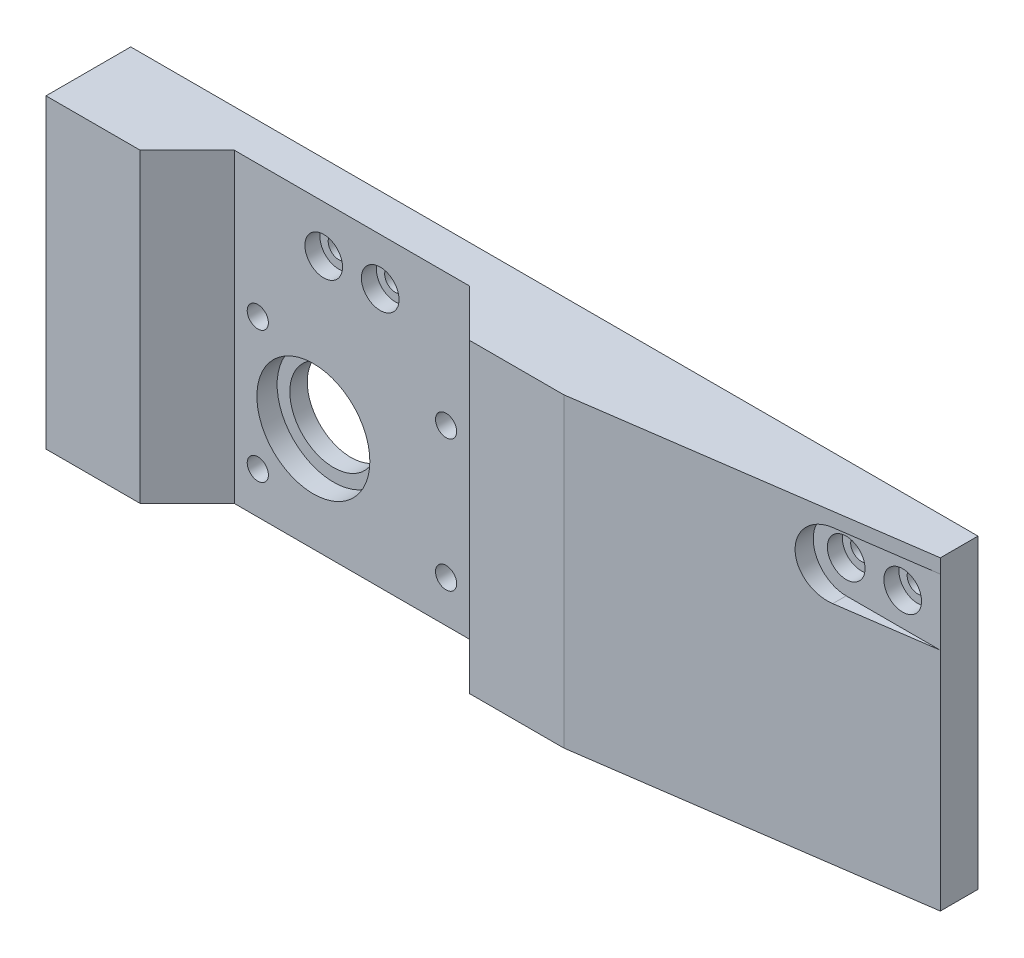
ISO-10303-21;
HEADER;
FILE_DESCRIPTION(('STEP AP214'),'2;1');
FILE_NAME('part.step','',(''),(''),'','','');
FILE_SCHEMA(('AUTOMOTIVE_DESIGN { 1 0 10303 214 1 1 1 1 }'));
ENDSEC;
DATA;
#1=APPLICATION_CONTEXT('core data for automotive mechanical design processes');
#2=APPLICATION_PROTOCOL_DEFINITION('international standard','automotive_design',2000,#1);
#3=PRODUCT_CONTEXT('',#1,'mechanical');
#4=PRODUCT('Part','Part','',(#3));
#5=PRODUCT_RELATED_PRODUCT_CATEGORY('part','',(#4));
#6=PRODUCT_DEFINITION_FORMATION('','',#4);
#7=PRODUCT_DEFINITION_CONTEXT('part definition',#1,'design');
#8=PRODUCT_DEFINITION('design','',#6,#7);
#9=PRODUCT_DEFINITION_SHAPE('','',#8);
#10=(LENGTH_UNIT() NAMED_UNIT(*) SI_UNIT(.MILLI.,.METRE.));
#11=(NAMED_UNIT(*) PLANE_ANGLE_UNIT() SI_UNIT($,.RADIAN.));
#12=(NAMED_UNIT(*) SI_UNIT($,.STERADIAN.) SOLID_ANGLE_UNIT());
#13=UNCERTAINTY_MEASURE_WITH_UNIT(LENGTH_MEASURE(1.E-05),#10,'distance_accuracy_value','');
#14=(GEOMETRIC_REPRESENTATION_CONTEXT(3) GLOBAL_UNCERTAINTY_ASSIGNED_CONTEXT((#13)) GLOBAL_UNIT_ASSIGNED_CONTEXT((#10,
#11,#12)) REPRESENTATION_CONTEXT('',''));
#15=CARTESIAN_POINT('',(0.,0.,0.));
#16=DIRECTION('',(0.,0.,1.));
#17=DIRECTION('',(1.,0.,0.));
#18=AXIS2_PLACEMENT_3D('',#15,#16,#17);
#19=CARTESIAN_POINT('',(110.,65.,18.));
#20=DIRECTION('',(-0.14142135623731,0.,-0.989949493661166));
#21=DIRECTION('',(-0.989949493661167,0.,0.14142135623731));
#22=AXIS2_PLACEMENT_3D('',#19,#20,#21);
#23=PLANE('',#22);
#24=DIRECTION('',(-0.989949493661167,0.,0.14142135623731));
#25=VECTOR('',#24,1.);
#26=CARTESIAN_POINT('',(110.,62.,18.));
#27=LINE('',#26,#25);
#28=CARTESIAN_POINT('',(180.,62.,8.));
#29=VERTEX_POINT('',#28);
#30=CARTESIAN_POINT('',(160.,62.,10.8571428571429));
#31=VERTEX_POINT('',#30);
#32=EDGE_CURVE('E11',#29,#31,#27,.T.);
#33=ORIENTED_EDGE('',*,*,#32,.F.);
#34=DIRECTION('',(0.,-1.,0.));
#35=VECTOR('',#34,1.);
#36=CARTESIAN_POINT('',(180.,65.,8.00000000000001));
#37=LINE('',#36,#35);
#38=CARTESIAN_POINT('',(180.,65.,8.00000000000001));
#39=VERTEX_POINT('',#38);
#40=EDGE_CURVE('E167',#39,#29,#37,.T.);
#41=ORIENTED_EDGE('',*,*,#40,.F.);
#42=DIRECTION('',(0.989949493661166,0.,-0.14142135623731));
#43=VECTOR('',#42,1.);
#44=CARTESIAN_POINT('',(110.,65.,18.));
#45=LINE('',#44,#43);
#46=CARTESIAN_POINT('',(110.,65.,18.));
#47=VERTEX_POINT('',#46);
#48=EDGE_CURVE('E56',#47,#39,#45,.T.);
#49=ORIENTED_EDGE('',*,*,#48,.F.);
#50=DIRECTION('',(0.,-1.,0.));
#51=VECTOR('',#50,1.);
#52=CARTESIAN_POINT('',(110.,65.,18.));
#53=LINE('',#52,#51);
#54=CARTESIAN_POINT('',(110.,0.,18.));
#55=VERTEX_POINT('',#54);
#56=EDGE_CURVE('E140',#47,#55,#53,.T.);
#57=ORIENTED_EDGE('',*,*,#56,.T.);
#58=DIRECTION('',(0.989949493661166,0.,-0.14142135623731));
#59=VECTOR('',#58,1.);
#60=CARTESIAN_POINT('',(110.,0.,18.));
#61=LINE('',#60,#59);
#62=CARTESIAN_POINT('',(180.,0.,8.00000000000001));
#63=VERTEX_POINT('',#62);
#64=EDGE_CURVE('E164',#55,#63,#61,.T.);
#65=ORIENTED_EDGE('',*,*,#64,.T.);
#66=CARTESIAN_POINT('',(180.,48.,8.00000000000001));
#67=VERTEX_POINT('',#66);
#68=EDGE_CURVE('E93',#67,#63,#37,.T.);
#69=ORIENTED_EDGE('',*,*,#68,.F.);
#70=DIRECTION('',(0.989949493661167,0.,-0.14142135623731));
#71=VECTOR('',#70,1.);
#72=CARTESIAN_POINT('',(110.,48.,18.));
#73=LINE('',#72,#71);
#74=CARTESIAN_POINT('',(160.,48.,10.8571428571429));
#75=VERTEX_POINT('',#74);
#76=EDGE_CURVE('E187',#75,#67,#73,.T.);
#77=ORIENTED_EDGE('',*,*,#76,.F.);
#78=CARTESIAN_POINT('',(160.,55.,10.8571428571429));
#79=DIRECTION('',(-0.14142135623731,0.,-0.989949493661166));
#80=DIRECTION('',(0.989949493661167,0.,-0.14142135623731));
#81=AXIS2_PLACEMENT_3D('',#78,#79,#80);
#82=ELLIPSE('',#81,7.07106781186547,7.);
#83=EDGE_CURVE('E40',#31,#75,#82,.F.);
#84=ORIENTED_EDGE('',*,*,#83,.F.);
#85=EDGE_LOOP('',(#33,#41,#49,#57,#65,#69,#77,#84));
#86=FACE_BOUND('',#85,.T.);
#87=ADVANCED_FACE('F32',(#86),#23,.F.);
#88=CARTESIAN_POINT('',(180.,65.,8.00000000000001));
#89=DIRECTION('',(-1.,0.,0.));
#90=DIRECTION('',(0.,0.,1.));
#91=AXIS2_PLACEMENT_3D('',#88,#89,#90);
#92=PLANE('',#91);
#93=DIRECTION('',(0.,0.,-1.));
#94=VECTOR('',#93,1.);
#95=CARTESIAN_POINT('',(180.,0.,8.00000000000001));
#96=LINE('',#95,#94);
#97=CARTESIAN_POINT('',(180.,0.,0.));
#98=VERTEX_POINT('',#97);
#99=EDGE_CURVE('E148',#63,#98,#96,.T.);
#100=ORIENTED_EDGE('',*,*,#99,.T.);
#101=DIRECTION('',(0.,-1.,0.));
#102=VECTOR('',#101,1.);
#103=CARTESIAN_POINT('',(180.,65.,0.));
#104=LINE('',#103,#102);
#105=CARTESIAN_POINT('',(180.,65.,0.));
#106=VERTEX_POINT('',#105);
#107=EDGE_CURVE('E185',#106,#98,#104,.T.);
#108=ORIENTED_EDGE('',*,*,#107,.F.);
#109=DIRECTION('',(0.,0.,-1.));
#110=VECTOR('',#109,1.);
#111=CARTESIAN_POINT('',(180.,65.,8.00000000000001));
#112=LINE('',#111,#110);
#113=EDGE_CURVE('E166',#39,#106,#112,.T.);
#114=ORIENTED_EDGE('',*,*,#113,.F.);
#115=ORIENTED_EDGE('',*,*,#40,.T.);
#116=EDGE_CURVE('E170',#29,#67,#37,.T.);
#117=ORIENTED_EDGE('',*,*,#116,.T.);
#118=ORIENTED_EDGE('',*,*,#68,.T.);
#119=EDGE_LOOP('',(#100,#108,#114,#115,#117,#118));
#120=FACE_BOUND('',#119,.T.);
#121=ADVANCED_FACE('F34',(#120),#92,.F.);
#122=CARTESIAN_POINT('',(180.,65.,0.));
#123=DIRECTION('',(0.,0.,1.));
#124=DIRECTION('',(1.,0.,0.));
#125=AXIS2_PLACEMENT_3D('',#122,#123,#124);
#126=PLANE('',#125);
#127=CARTESIAN_POINT('',(35.,36.853925583054,0.));
#128=DIRECTION('',(0.,0.,1.));
#129=DIRECTION('',(1.,0.,0.));
#130=AXIS2_PLACEMENT_3D('',#127,#128,#129);
#131=CIRCLE('',#130,2.25);
#132=CARTESIAN_POINT('',(37.25,36.853925583054,0.));
#133=VERTEX_POINT('',#132);
#134=EDGE_CURVE('E692',#133,#133,#131,.T.);
#135=ORIENTED_EDGE('',*,*,#134,.T.);
#136=EDGE_LOOP('',(#135));
#137=FACE_BOUND('',#136,.T.);
#138=CARTESIAN_POINT('',(75.,36.853925583054,0.));
#139=DIRECTION('',(0.,0.,1.));
#140=DIRECTION('',(1.,0.,0.));
#141=AXIS2_PLACEMENT_3D('',#138,#139,#140);
#142=CIRCLE('',#141,2.25);
#143=CARTESIAN_POINT('',(77.25,36.853925583054,0.));
#144=VERTEX_POINT('',#143);
#145=EDGE_CURVE('E702',#144,#144,#142,.T.);
#146=ORIENTED_EDGE('',*,*,#145,.T.);
#147=EDGE_LOOP('',(#146));
#148=FACE_BOUND('',#147,.T.);
#149=CARTESIAN_POINT('',(75.,8.85392558305398,0.));
#150=DIRECTION('',(0.,0.,1.));
#151=DIRECTION('',(1.,0.,0.));
#152=AXIS2_PLACEMENT_3D('',#149,#150,#151);
#153=CIRCLE('',#152,2.25);
#154=CARTESIAN_POINT('',(77.25,8.85392558305398,0.));
#155=VERTEX_POINT('',#154);
#156=EDGE_CURVE('E708',#155,#155,#153,.T.);
#157=ORIENTED_EDGE('',*,*,#156,.T.);
#158=EDGE_LOOP('',(#157));
#159=FACE_BOUND('',#158,.T.);
#160=CARTESIAN_POINT('',(35.,8.85392558305398,0.));
#161=DIRECTION('',(0.,0.,1.));
#162=DIRECTION('',(1.,0.,0.));
#163=AXIS2_PLACEMENT_3D('',#160,#161,#162);
#164=CIRCLE('',#163,2.25);
#165=CARTESIAN_POINT('',(37.25,8.85392558305398,0.));
#166=VERTEX_POINT('',#165);
#167=EDGE_CURVE('E714',#166,#166,#164,.T.);
#168=ORIENTED_EDGE('',*,*,#167,.T.);
#169=EDGE_LOOP('',(#168));
#170=FACE_BOUND('',#169,.T.);
#171=CARTESIAN_POINT('',(46.8,22.15,0.));
#172=DIRECTION('',(0.,0.,1.));
#173=DIRECTION('',(1.,0.,0.));
#174=AXIS2_PLACEMENT_3D('',#171,#172,#173);
#175=CIRCLE('',#174,9.30000000000001);
#176=CARTESIAN_POINT('',(56.1,22.15,0.));
#177=VERTEX_POINT('',#176);
#178=EDGE_CURVE('E720',#177,#177,#175,.F.);
#179=ORIENTED_EDGE('',*,*,#178,.F.);
#180=EDGE_LOOP('',(#179));
#181=FACE_BOUND('',#180,.T.);
#182=CARTESIAN_POINT('',(160.,55.,0.));
#183=DIRECTION('',(0.,0.,1.));
#184=DIRECTION('',(1.,0.,0.));
#185=AXIS2_PLACEMENT_3D('',#182,#183,#184);
#186=CIRCLE('',#185,2.25);
#187=CARTESIAN_POINT('',(162.25,55.,0.));
#188=VERTEX_POINT('',#187);
#189=EDGE_CURVE('E738',#188,#188,#186,.T.);
#190=ORIENTED_EDGE('',*,*,#189,.T.);
#191=EDGE_LOOP('',(#190));
#192=FACE_BOUND('',#191,.T.);
#193=CARTESIAN_POINT('',(172.,55.,0.));
#194=DIRECTION('',(0.,0.,1.));
#195=DIRECTION('',(1.,0.,0.));
#196=AXIS2_PLACEMENT_3D('',#193,#194,#195);
#197=CIRCLE('',#196,2.25);
#198=CARTESIAN_POINT('',(174.25,55.,0.));
#199=VERTEX_POINT('',#198);
#200=EDGE_CURVE('E750',#199,#199,#197,.T.);
#201=ORIENTED_EDGE('',*,*,#200,.T.);
#202=EDGE_LOOP('',(#201));
#203=FACE_BOUND('',#202,.T.);
#204=CARTESIAN_POINT('',(49.,55.,0.));
#205=DIRECTION('',(0.,0.,1.));
#206=DIRECTION('',(1.,0.,0.));
#207=AXIS2_PLACEMENT_3D('',#204,#205,#206);
#208=CIRCLE('',#207,2.25);
#209=CARTESIAN_POINT('',(51.25,55.,0.));
#210=VERTEX_POINT('',#209);
#211=EDGE_CURVE('E762',#210,#210,#208,.T.);
#212=ORIENTED_EDGE('',*,*,#211,.T.);
#213=EDGE_LOOP('',(#212));
#214=FACE_BOUND('',#213,.T.);
#215=CARTESIAN_POINT('',(61.,55.,0.));
#216=DIRECTION('',(0.,0.,1.));
#217=DIRECTION('',(1.,0.,0.));
#218=AXIS2_PLACEMENT_3D('',#215,#216,#217);
#219=CIRCLE('',#218,2.25);
#220=CARTESIAN_POINT('',(63.25,55.,0.));
#221=VERTEX_POINT('',#220);
#222=EDGE_CURVE('E222',#221,#221,#219,.T.);
#223=ORIENTED_EDGE('',*,*,#222,.T.);
#224=EDGE_LOOP('',(#223));
#225=FACE_BOUND('',#224,.T.);
#226=DIRECTION('',(-1.,0.,0.));
#227=VECTOR('',#226,1.);
#228=CARTESIAN_POINT('',(180.,0.,0.));
#229=LINE('',#228,#227);
#230=CARTESIAN_POINT('',(0.,0.,0.));
#231=VERTEX_POINT('',#230);
#232=EDGE_CURVE('E150',#98,#231,#229,.T.);
#233=ORIENTED_EDGE('',*,*,#232,.T.);
#234=DIRECTION('',(0.,-1.,0.));
#235=VECTOR('',#234,1.);
#236=CARTESIAN_POINT('',(0.,65.,0.));
#237=LINE('',#236,#235);
#238=CARTESIAN_POINT('',(0.,65.,0.));
#239=VERTEX_POINT('',#238);
#240=EDGE_CURVE('E182',#239,#231,#237,.T.);
#241=ORIENTED_EDGE('',*,*,#240,.F.);
#242=DIRECTION('',(-1.,0.,0.));
#243=VECTOR('',#242,1.);
#244=CARTESIAN_POINT('',(180.,65.,0.));
#245=LINE('',#244,#243);
#246=EDGE_CURVE('E102',#106,#239,#245,.T.);
#247=ORIENTED_EDGE('',*,*,#246,.F.);
#248=ORIENTED_EDGE('',*,*,#107,.T.);
#249=EDGE_LOOP('',(#233,#241,#247,#248));
#250=FACE_BOUND('',#249,.T.);
#251=ADVANCED_FACE('F249',(#137,#148,#159,#170,#181,#192,#203,#214,#225,#250),#126,.F.);
#252=CARTESIAN_POINT('',(0.,65.,0.));
#253=DIRECTION('',(1.,0.,0.));
#254=DIRECTION('',(0.,0.,-1.));
#255=AXIS2_PLACEMENT_3D('',#252,#253,#254);
#256=PLANE('',#255);
#257=DIRECTION('',(0.,0.,1.));
#258=VECTOR('',#257,1.);
#259=CARTESIAN_POINT('',(0.,0.,0.));
#260=LINE('',#259,#258);
#261=CARTESIAN_POINT('',(0.,0.,18.));
#262=VERTEX_POINT('',#261);
#263=EDGE_CURVE('E153',#231,#262,#260,.T.);
#264=ORIENTED_EDGE('',*,*,#263,.T.);
#265=DIRECTION('',(0.,-1.,0.));
#266=VECTOR('',#265,1.);
#267=CARTESIAN_POINT('',(0.,65.,18.));
#268=LINE('',#267,#266);
#269=CARTESIAN_POINT('',(0.,65.,18.));
#270=VERTEX_POINT('',#269);
#271=EDGE_CURVE('E179',#270,#262,#268,.T.);
#272=ORIENTED_EDGE('',*,*,#271,.F.);
#273=DIRECTION('',(0.,0.,1.));
#274=VECTOR('',#273,1.);
#275=CARTESIAN_POINT('',(0.,65.,0.));
#276=LINE('',#275,#274);
#277=EDGE_CURVE('E226',#239,#270,#276,.T.);
#278=ORIENTED_EDGE('',*,*,#277,.F.);
#279=ORIENTED_EDGE('',*,*,#240,.T.);
#280=EDGE_LOOP('',(#264,#272,#278,#279));
#281=FACE_BOUND('',#280,.T.);
#282=ADVANCED_FACE('F251',(#281),#256,.F.);
#283=CARTESIAN_POINT('',(0.,65.,18.));
#284=DIRECTION('',(0.,0.,-1.));
#285=DIRECTION('',(-1.,0.,0.));
#286=AXIS2_PLACEMENT_3D('',#283,#284,#285);
#287=PLANE('',#286);
#288=DIRECTION('',(1.,0.,0.));
#289=VECTOR('',#288,1.);
#290=CARTESIAN_POINT('',(0.,0.,18.));
#291=LINE('',#290,#289);
#292=CARTESIAN_POINT('',(20.,0.,18.));
#293=VERTEX_POINT('',#292);
#294=EDGE_CURVE('E155',#262,#293,#291,.T.);
#295=ORIENTED_EDGE('',*,*,#294,.T.);
#296=DIRECTION('',(0.,-1.,0.));
#297=VECTOR('',#296,1.);
#298=CARTESIAN_POINT('',(20.,65.,18.));
#299=LINE('',#298,#297);
#300=CARTESIAN_POINT('',(20.,65.,18.));
#301=VERTEX_POINT('',#300);
#302=EDGE_CURVE('E176',#301,#293,#299,.T.);
#303=ORIENTED_EDGE('',*,*,#302,.F.);
#304=DIRECTION('',(1.,0.,0.));
#305=VECTOR('',#304,1.);
#306=CARTESIAN_POINT('',(0.,65.,18.));
#307=LINE('',#306,#305);
#308=EDGE_CURVE('E232',#270,#301,#307,.T.);
#309=ORIENTED_EDGE('',*,*,#308,.F.);
#310=ORIENTED_EDGE('',*,*,#271,.T.);
#311=EDGE_LOOP('',(#295,#303,#309,#310));
#312=FACE_BOUND('',#311,.T.);
#313=ADVANCED_FACE('F257',(#312),#287,.F.);
#314=CARTESIAN_POINT('',(20.,65.,18.));
#315=DIRECTION('',(-0.707106781186549,0.,-0.707106781186546));
#316=DIRECTION('',(-0.707106781186546,0.,0.707106781186549));
#317=AXIS2_PLACEMENT_3D('',#314,#315,#316);
#318=PLANE('',#317);
#319=DIRECTION('',(0.707106781186546,0.,-0.707106781186549));
#320=VECTOR('',#319,1.);
#321=CARTESIAN_POINT('',(20.,0.,18.));
#322=LINE('',#321,#320);
#323=CARTESIAN_POINT('',(30.,0.,8.00000000000002));
#324=VERTEX_POINT('',#323);
#325=EDGE_CURVE('E157',#293,#324,#322,.T.);
#326=ORIENTED_EDGE('',*,*,#325,.T.);
#327=DIRECTION('',(0.,-1.,0.));
#328=VECTOR('',#327,1.);
#329=CARTESIAN_POINT('',(30.,65.,8.00000000000002));
#330=LINE('',#329,#328);
#331=CARTESIAN_POINT('',(30.,65.,8.00000000000002));
#332=VERTEX_POINT('',#331);
#333=EDGE_CURVE('E173',#332,#324,#330,.T.);
#334=ORIENTED_EDGE('',*,*,#333,.F.);
#335=DIRECTION('',(0.707106781186546,0.,-0.707106781186549));
#336=VECTOR('',#335,1.);
#337=CARTESIAN_POINT('',(20.,65.,18.));
#338=LINE('',#337,#336);
#339=EDGE_CURVE('E234',#301,#332,#338,.T.);
#340=ORIENTED_EDGE('',*,*,#339,.F.);
#341=ORIENTED_EDGE('',*,*,#302,.T.);
#342=EDGE_LOOP('',(#326,#334,#340,#341));
#343=FACE_BOUND('',#342,.T.);
#344=ADVANCED_FACE('F240',(#343),#318,.F.);
#345=CARTESIAN_POINT('',(30.,65.,8.00000000000002));
#346=DIRECTION('',(0.,0.,-1.));
#347=DIRECTION('',(-1.,0.,0.));
#348=AXIS2_PLACEMENT_3D('',#345,#346,#347);
#349=PLANE('',#348);
#350=CARTESIAN_POINT('',(35.,36.853925583054,8.00000000000002));
#351=DIRECTION('',(0.,0.,1.));
#352=DIRECTION('',(1.,0.,0.));
#353=AXIS2_PLACEMENT_3D('',#350,#351,#352);
#354=CIRCLE('',#353,2.25);
#355=CARTESIAN_POINT('',(37.25,36.853925583054,8.00000000000002));
#356=VERTEX_POINT('',#355);
#357=EDGE_CURVE('E695',#356,#356,#354,.T.);
#358=ORIENTED_EDGE('',*,*,#357,.F.);
#359=EDGE_LOOP('',(#358));
#360=FACE_BOUND('',#359,.T.);
#361=CARTESIAN_POINT('',(75.,36.853925583054,8.00000000000002));
#362=DIRECTION('',(0.,0.,1.));
#363=DIRECTION('',(1.,0.,0.));
#364=AXIS2_PLACEMENT_3D('',#361,#362,#363);
#365=CIRCLE('',#364,2.25);
#366=CARTESIAN_POINT('',(77.25,36.853925583054,8.00000000000002));
#367=VERTEX_POINT('',#366);
#368=EDGE_CURVE('E697',#367,#367,#365,.T.);
#369=ORIENTED_EDGE('',*,*,#368,.F.);
#370=EDGE_LOOP('',(#369));
#371=FACE_BOUND('',#370,.T.);
#372=CARTESIAN_POINT('',(75.,8.85392558305398,8.00000000000002));
#373=DIRECTION('',(0.,0.,1.));
#374=DIRECTION('',(1.,0.,0.));
#375=AXIS2_PLACEMENT_3D('',#372,#373,#374);
#376=CIRCLE('',#375,2.25);
#377=CARTESIAN_POINT('',(77.25,8.85392558305398,8.00000000000002));
#378=VERTEX_POINT('',#377);
#379=EDGE_CURVE('E705',#378,#378,#376,.T.);
#380=ORIENTED_EDGE('',*,*,#379,.F.);
#381=EDGE_LOOP('',(#380));
#382=FACE_BOUND('',#381,.T.);
#383=CARTESIAN_POINT('',(35.,8.85392558305398,8.00000000000002));
#384=DIRECTION('',(0.,0.,1.));
#385=DIRECTION('',(1.,0.,0.));
#386=AXIS2_PLACEMENT_3D('',#383,#384,#385);
#387=CIRCLE('',#386,2.25);
#388=CARTESIAN_POINT('',(37.25,8.85392558305398,8.00000000000002));
#389=VERTEX_POINT('',#388);
#390=EDGE_CURVE('E711',#389,#389,#387,.T.);
#391=ORIENTED_EDGE('',*,*,#390,.F.);
#392=EDGE_LOOP('',(#391));
#393=FACE_BOUND('',#392,.T.);
#394=CARTESIAN_POINT('',(46.8,22.15,8.00000000000002));
#395=DIRECTION('',(0.,0.,1.));
#396=DIRECTION('',(1.,0.,0.));
#397=AXIS2_PLACEMENT_3D('',#394,#395,#396);
#398=CIRCLE('',#397,12.);
#399=CARTESIAN_POINT('',(58.8,22.15,8.00000000000002));
#400=VERTEX_POINT('',#399);
#401=EDGE_CURVE('E723',#400,#400,#398,.T.);
#402=ORIENTED_EDGE('',*,*,#401,.F.);
#403=EDGE_LOOP('',(#402));
#404=FACE_BOUND('',#403,.T.);
#405=CARTESIAN_POINT('',(49.,55.,8.));
#406=DIRECTION('',(0.,0.,1.));
#407=DIRECTION('',(1.,0.,0.));
#408=AXIS2_PLACEMENT_3D('',#405,#406,#407);
#409=CIRCLE('',#408,3.99999999999999);
#410=CARTESIAN_POINT('',(53.,55.,8.));
#411=VERTEX_POINT('',#410);
#412=EDGE_CURVE('E753',#411,#411,#409,.T.);
#413=ORIENTED_EDGE('',*,*,#412,.F.);
#414=EDGE_LOOP('',(#413));
#415=FACE_BOUND('',#414,.T.);
#416=CARTESIAN_POINT('',(61.,55.,8.));
#417=DIRECTION('',(0.,0.,1.));
#418=DIRECTION('',(1.,0.,0.));
#419=AXIS2_PLACEMENT_3D('',#416,#417,#418);
#420=CIRCLE('',#419,3.99999999999999);
#421=CARTESIAN_POINT('',(65.,55.,8.));
#422=VERTEX_POINT('',#421);
#423=EDGE_CURVE('E765',#422,#422,#420,.T.);
#424=ORIENTED_EDGE('',*,*,#423,.F.);
#425=EDGE_LOOP('',(#424));
#426=FACE_BOUND('',#425,.T.);
#427=DIRECTION('',(1.,0.,0.));
#428=VECTOR('',#427,1.);
#429=CARTESIAN_POINT('',(30.,0.,8.00000000000002));
#430=LINE('',#429,#428);
#431=CARTESIAN_POINT('',(80.,0.,8.00000000000002));
#432=VERTEX_POINT('',#431);
#433=EDGE_CURVE('E159',#324,#432,#430,.T.);
#434=ORIENTED_EDGE('',*,*,#433,.T.);
#435=DIRECTION('',(0.,-1.,0.));
#436=VECTOR('',#435,1.);
#437=CARTESIAN_POINT('',(80.,65.,8.00000000000002));
#438=LINE('',#437,#436);
#439=CARTESIAN_POINT('',(80.,65.,8.00000000000002));
#440=VERTEX_POINT('',#439);
#441=EDGE_CURVE('E139',#440,#432,#438,.T.);
#442=ORIENTED_EDGE('',*,*,#441,.F.);
#443=DIRECTION('',(1.,0.,0.));
#444=VECTOR('',#443,1.);
#445=CARTESIAN_POINT('',(30.,65.,8.00000000000002));
#446=LINE('',#445,#444);
#447=EDGE_CURVE('E127',#332,#440,#446,.T.);
#448=ORIENTED_EDGE('',*,*,#447,.F.);
#449=ORIENTED_EDGE('',*,*,#333,.T.);
#450=EDGE_LOOP('',(#434,#442,#448,#449));
#451=FACE_BOUND('',#450,.T.);
#452=ADVANCED_FACE('F244',(#360,#371,#382,#393,#404,#415,#426,#451),#349,.F.);
#453=CARTESIAN_POINT('',(80.,65.,8.00000000000002));
#454=DIRECTION('',(0.707106781186549,0.,-0.707106781186546));
#455=DIRECTION('',(-0.707106781186546,0.,-0.707106781186549));
#456=AXIS2_PLACEMENT_3D('',#453,#454,#455);
#457=PLANE('',#456);
#458=DIRECTION('',(0.707106781186546,0.,0.707106781186549));
#459=VECTOR('',#458,1.);
#460=CARTESIAN_POINT('',(80.,0.,8.00000000000002));
#461=LINE('',#460,#459);
#462=CARTESIAN_POINT('',(89.9999999999999,0.,18.));
#463=VERTEX_POINT('',#462);
#464=EDGE_CURVE('E136',#432,#463,#461,.T.);
#465=ORIENTED_EDGE('',*,*,#464,.T.);
#466=DIRECTION('',(0.,-1.,0.));
#467=VECTOR('',#466,1.);
#468=CARTESIAN_POINT('',(89.9999999999999,65.,18.));
#469=LINE('',#468,#467);
#470=CARTESIAN_POINT('',(89.9999999999999,65.,18.));
#471=VERTEX_POINT('',#470);
#472=EDGE_CURVE('E133',#471,#463,#469,.T.);
#473=ORIENTED_EDGE('',*,*,#472,.F.);
#474=DIRECTION('',(0.707106781186546,0.,0.707106781186549));
#475=VECTOR('',#474,1.);
#476=CARTESIAN_POINT('',(80.,65.,8.00000000000002));
#477=LINE('',#476,#475);
#478=EDGE_CURVE('E120',#440,#471,#477,.T.);
#479=ORIENTED_EDGE('',*,*,#478,.F.);
#480=ORIENTED_EDGE('',*,*,#441,.T.);
#481=EDGE_LOOP('',(#465,#473,#479,#480));
#482=FACE_BOUND('',#481,.T.);
#483=ADVANCED_FACE('F134',(#482),#457,.F.);
#484=CARTESIAN_POINT('',(89.9999999999999,65.,18.));
#485=DIRECTION('',(0.,0.,-1.));
#486=DIRECTION('',(-1.,0.,0.));
#487=AXIS2_PLACEMENT_3D('',#484,#485,#486);
#488=PLANE('',#487);
#489=DIRECTION('',(1.,0.,0.));
#490=VECTOR('',#489,1.);
#491=CARTESIAN_POINT('',(89.9999999999999,0.,18.));
#492=LINE('',#491,#490);
#493=EDGE_CURVE('E162',#463,#55,#492,.T.);
#494=ORIENTED_EDGE('',*,*,#493,.T.);
#495=ORIENTED_EDGE('',*,*,#56,.F.);
#496=DIRECTION('',(1.,0.,0.));
#497=VECTOR('',#496,1.);
#498=CARTESIAN_POINT('',(89.9999999999999,65.,18.));
#499=LINE('',#498,#497);
#500=EDGE_CURVE('E124',#471,#47,#499,.T.);
#501=ORIENTED_EDGE('',*,*,#500,.F.);
#502=ORIENTED_EDGE('',*,*,#472,.T.);
#503=EDGE_LOOP('',(#494,#495,#501,#502));
#504=FACE_BOUND('',#503,.T.);
#505=ADVANCED_FACE('F142',(#504),#488,.F.);
#506=CARTESIAN_POINT('',(0.,65.,0.));
#507=DIRECTION('',(0.,1.,0.));
#508=DIRECTION('',(0.,0.,1.));
#509=AXIS2_PLACEMENT_3D('',#506,#507,#508);
#510=PLANE('',#509);
#511=ORIENTED_EDGE('',*,*,#113,.T.);
#512=ORIENTED_EDGE('',*,*,#246,.T.);
#513=ORIENTED_EDGE('',*,*,#277,.T.);
#514=ORIENTED_EDGE('',*,*,#308,.T.);
#515=ORIENTED_EDGE('',*,*,#339,.T.);
#516=ORIENTED_EDGE('',*,*,#447,.T.);
#517=ORIENTED_EDGE('',*,*,#478,.T.);
#518=ORIENTED_EDGE('',*,*,#500,.T.);
#519=ORIENTED_EDGE('',*,*,#48,.T.);
#520=EDGE_LOOP('',(#511,#512,#513,#514,#515,#516,#517,#518,#519));
#521=FACE_BOUND('',#520,.T.);
#522=ADVANCED_FACE('F122',(#521),#510,.T.);
#523=CARTESIAN_POINT('',(0.,0.,0.));
#524=DIRECTION('',(0.,1.,0.));
#525=DIRECTION('',(0.,0.,1.));
#526=AXIS2_PLACEMENT_3D('',#523,#524,#525);
#527=PLANE('',#526);
#528=CARTESIAN_POINT('',(5.,0.,13.));
#529=DIRECTION('',(0.,-1.,0.));
#530=DIRECTION('',(0.,0.,-1.));
#531=AXIS2_PLACEMENT_3D('',#528,#529,#530);
#532=CIRCLE('',#531,2.);
#533=CARTESIAN_POINT('',(5.,0.,11.));
#534=VERTEX_POINT('',#533);
#535=EDGE_CURVE('E779',#534,#534,#532,.T.);
#536=ORIENTED_EDGE('',*,*,#535,.F.);
#537=EDGE_LOOP('',(#536));
#538=FACE_BOUND('',#537,.T.);
#539=CARTESIAN_POINT('',(15.,0.,13.));
#540=DIRECTION('',(0.,-1.,0.));
#541=DIRECTION('',(0.,0.,-1.));
#542=AXIS2_PLACEMENT_3D('',#539,#540,#541);
#543=CIRCLE('',#542,2.);
#544=CARTESIAN_POINT('',(15.,0.,11.));
#545=VERTEX_POINT('',#544);
#546=EDGE_CURVE('E785',#545,#545,#543,.T.);
#547=ORIENTED_EDGE('',*,*,#546,.F.);
#548=EDGE_LOOP('',(#547));
#549=FACE_BOUND('',#548,.T.);
#550=CARTESIAN_POINT('',(94.9999999999999,0.,13.));
#551=DIRECTION('',(0.,-1.,0.));
#552=DIRECTION('',(0.,0.,-1.));
#553=AXIS2_PLACEMENT_3D('',#550,#551,#552);
#554=CIRCLE('',#553,2.);
#555=CARTESIAN_POINT('',(94.9999999999999,0.,11.));
#556=VERTEX_POINT('',#555);
#557=EDGE_CURVE('E791',#556,#556,#554,.T.);
#558=ORIENTED_EDGE('',*,*,#557,.F.);
#559=EDGE_LOOP('',(#558));
#560=FACE_BOUND('',#559,.T.);
#561=CARTESIAN_POINT('',(105.,0.,13.));
#562=DIRECTION('',(0.,-1.,0.));
#563=DIRECTION('',(0.,0.,-1.));
#564=AXIS2_PLACEMENT_3D('',#561,#562,#563);
#565=CIRCLE('',#564,2.);
#566=CARTESIAN_POINT('',(105.,0.,11.));
#567=VERTEX_POINT('',#566);
#568=EDGE_CURVE('E797',#567,#567,#565,.T.);
#569=ORIENTED_EDGE('',*,*,#568,.F.);
#570=EDGE_LOOP('',(#569));
#571=FACE_BOUND('',#570,.T.);
#572=CARTESIAN_POINT('',(22.5,0.,4.99999999999999));
#573=DIRECTION('',(0.,-1.,0.));
#574=DIRECTION('',(0.,0.,-1.));
#575=AXIS2_PLACEMENT_3D('',#572,#573,#574);
#576=CIRCLE('',#575,2.);
#577=CARTESIAN_POINT('',(22.5,0.,2.99999999999999));
#578=VERTEX_POINT('',#577);
#579=EDGE_CURVE('E803',#578,#578,#576,.T.);
#580=ORIENTED_EDGE('',*,*,#579,.F.);
#581=EDGE_LOOP('',(#580));
#582=FACE_BOUND('',#581,.T.);
#583=CARTESIAN_POINT('',(87.4999999999999,0.,4.99999999999999));
#584=DIRECTION('',(0.,-1.,0.));
#585=DIRECTION('',(0.,0.,-1.));
#586=AXIS2_PLACEMENT_3D('',#583,#584,#585);
#587=CIRCLE('',#586,2.);
#588=CARTESIAN_POINT('',(87.4999999999999,0.,2.99999999999999));
#589=VERTEX_POINT('',#588);
#590=EDGE_CURVE('E808',#589,#589,#587,.T.);
#591=ORIENTED_EDGE('',*,*,#590,.F.);
#592=EDGE_LOOP('',(#591));
#593=FACE_BOUND('',#592,.T.);
#594=ORIENTED_EDGE('',*,*,#99,.F.);
#595=ORIENTED_EDGE('',*,*,#64,.F.);
#596=ORIENTED_EDGE('',*,*,#493,.F.);
#597=ORIENTED_EDGE('',*,*,#464,.F.);
#598=ORIENTED_EDGE('',*,*,#433,.F.);
#599=ORIENTED_EDGE('',*,*,#325,.F.);
#600=ORIENTED_EDGE('',*,*,#294,.F.);
#601=ORIENTED_EDGE('',*,*,#263,.F.);
#602=ORIENTED_EDGE('',*,*,#232,.F.);
#603=EDGE_LOOP('',(#594,#595,#596,#597,#598,#599,#600,#601,#602));
#604=FACE_BOUND('',#603,.T.);
#605=ADVANCED_FACE('F246',(#538,#549,#560,#571,#582,#593,#604),#527,.F.);
#606=CARTESIAN_POINT('',(87.4999999999999,7.1,4.99999999999999));
#607=DIRECTION('',(0.,-1.,0.));
#608=DIRECTION('',(0.,0.,-1.));
#609=AXIS2_PLACEMENT_3D('',#606,#607,#608);
#610=CONICAL_SURFACE('',#609,2.,1.02974425867665);
#611=CARTESIAN_POINT('',(87.4999999999999,8.30172123805512,4.99999999999999));
#612=VERTEX_POINT('',#611);
#613=VERTEX_LOOP('',#612);
#614=FACE_BOUND('',#613,.T.);
#615=CARTESIAN_POINT('',(87.4999999999999,7.1,4.99999999999999));
#616=DIRECTION('',(0.,-1.,0.));
#617=DIRECTION('',(0.,0.,-1.));
#618=AXIS2_PLACEMENT_3D('',#615,#616,#617);
#619=CIRCLE('',#618,2.);
#620=CARTESIAN_POINT('',(87.4999999999999,7.1,2.99999999999999));
#621=VERTEX_POINT('',#620);
#622=EDGE_CURVE('E151',#621,#621,#619,.T.);
#623=ORIENTED_EDGE('',*,*,#622,.T.);
#624=EDGE_LOOP('',(#623));
#625=FACE_BOUND('',#624,.T.);
#626=ADVANCED_FACE('F314',(#614,#625),#610,.F.);
#627=CARTESIAN_POINT('',(87.4999999999999,0.,4.99999999999999));
#628=DIRECTION('',(0.,-1.,0.));
#629=DIRECTION('',(0.,0.,-1.));
#630=AXIS2_PLACEMENT_3D('',#627,#628,#629);
#631=CYLINDRICAL_SURFACE('',#630,2.);
#632=ORIENTED_EDGE('',*,*,#622,.F.);
#633=EDGE_LOOP('',(#632));
#634=FACE_BOUND('',#633,.T.);
#635=ORIENTED_EDGE('',*,*,#590,.T.);
#636=EDGE_LOOP('',(#635));
#637=FACE_BOUND('',#636,.T.);
#638=ADVANCED_FACE('F321',(#634,#637),#631,.F.);
#639=CARTESIAN_POINT('',(22.5,7.1,4.99999999999999));
#640=DIRECTION('',(0.,-1.,0.));
#641=DIRECTION('',(0.,0.,-1.));
#642=AXIS2_PLACEMENT_3D('',#639,#640,#641);
#643=CONICAL_SURFACE('',#642,2.,1.02974425867665);
#644=CARTESIAN_POINT('',(22.5,8.30172123805512,4.99999999999999));
#645=VERTEX_POINT('',#644);
#646=VERTEX_LOOP('',#645);
#647=FACE_BOUND('',#646,.T.);
#648=CARTESIAN_POINT('',(22.5,7.1,4.99999999999999));
#649=DIRECTION('',(0.,-1.,0.));
#650=DIRECTION('',(0.,0.,-1.));
#651=AXIS2_PLACEMENT_3D('',#648,#649,#650);
#652=CIRCLE('',#651,2.);
#653=CARTESIAN_POINT('',(22.5,7.1,2.99999999999999));
#654=VERTEX_POINT('',#653);
#655=EDGE_CURVE('E806',#654,#654,#652,.T.);
#656=ORIENTED_EDGE('',*,*,#655,.T.);
#657=EDGE_LOOP('',(#656));
#658=FACE_BOUND('',#657,.T.);
#659=ADVANCED_FACE('F329',(#647,#658),#643,.F.);
#660=CARTESIAN_POINT('',(22.5,0.,4.99999999999999));
#661=DIRECTION('',(0.,-1.,0.));
#662=DIRECTION('',(0.,0.,-1.));
#663=AXIS2_PLACEMENT_3D('',#660,#661,#662);
#664=CYLINDRICAL_SURFACE('',#663,2.);
#665=ORIENTED_EDGE('',*,*,#655,.F.);
#666=EDGE_LOOP('',(#665));
#667=FACE_BOUND('',#666,.T.);
#668=ORIENTED_EDGE('',*,*,#579,.T.);
#669=EDGE_LOOP('',(#668));
#670=FACE_BOUND('',#669,.T.);
#671=ADVANCED_FACE('F337',(#667,#670),#664,.F.);
#672=CARTESIAN_POINT('',(105.,7.1,13.));
#673=DIRECTION('',(0.,-1.,0.));
#674=DIRECTION('',(0.,0.,-1.));
#675=AXIS2_PLACEMENT_3D('',#672,#673,#674);
#676=CONICAL_SURFACE('',#675,2.,1.02974425867665);
#677=CARTESIAN_POINT('',(105.,8.30172123805512,13.));
#678=VERTEX_POINT('',#677);
#679=VERTEX_LOOP('',#678);
#680=FACE_BOUND('',#679,.T.);
#681=CARTESIAN_POINT('',(105.,7.1,13.));
#682=DIRECTION('',(0.,-1.,0.));
#683=DIRECTION('',(0.,0.,-1.));
#684=AXIS2_PLACEMENT_3D('',#681,#682,#683);
#685=CIRCLE('',#684,2.);
#686=CARTESIAN_POINT('',(105.,7.1,11.));
#687=VERTEX_POINT('',#686);
#688=EDGE_CURVE('E800',#687,#687,#685,.T.);
#689=ORIENTED_EDGE('',*,*,#688,.T.);
#690=EDGE_LOOP('',(#689));
#691=FACE_BOUND('',#690,.T.);
#692=ADVANCED_FACE('F345',(#680,#691),#676,.F.);
#693=CARTESIAN_POINT('',(105.,0.,13.));
#694=DIRECTION('',(0.,-1.,0.));
#695=DIRECTION('',(0.,0.,-1.));
#696=AXIS2_PLACEMENT_3D('',#693,#694,#695);
#697=CYLINDRICAL_SURFACE('',#696,2.);
#698=ORIENTED_EDGE('',*,*,#688,.F.);
#699=EDGE_LOOP('',(#698));
#700=FACE_BOUND('',#699,.T.);
#701=ORIENTED_EDGE('',*,*,#568,.T.);
#702=EDGE_LOOP('',(#701));
#703=FACE_BOUND('',#702,.T.);
#704=ADVANCED_FACE('F353',(#700,#703),#697,.F.);
#705=CARTESIAN_POINT('',(94.9999999999999,7.1,13.));
#706=DIRECTION('',(0.,-1.,0.));
#707=DIRECTION('',(0.,0.,-1.));
#708=AXIS2_PLACEMENT_3D('',#705,#706,#707);
#709=CONICAL_SURFACE('',#708,2.,1.02974425867665);
#710=CARTESIAN_POINT('',(94.9999999999999,8.30172123805512,13.));
#711=VERTEX_POINT('',#710);
#712=VERTEX_LOOP('',#711);
#713=FACE_BOUND('',#712,.T.);
#714=CARTESIAN_POINT('',(94.9999999999999,7.1,13.));
#715=DIRECTION('',(0.,-1.,0.));
#716=DIRECTION('',(0.,0.,-1.));
#717=AXIS2_PLACEMENT_3D('',#714,#715,#716);
#718=CIRCLE('',#717,2.);
#719=CARTESIAN_POINT('',(94.9999999999999,7.1,11.));
#720=VERTEX_POINT('',#719);
#721=EDGE_CURVE('E794',#720,#720,#718,.T.);
#722=ORIENTED_EDGE('',*,*,#721,.T.);
#723=EDGE_LOOP('',(#722));
#724=FACE_BOUND('',#723,.T.);
#725=ADVANCED_FACE('F361',(#713,#724),#709,.F.);
#726=CARTESIAN_POINT('',(94.9999999999999,0.,13.));
#727=DIRECTION('',(0.,-1.,0.));
#728=DIRECTION('',(0.,0.,-1.));
#729=AXIS2_PLACEMENT_3D('',#726,#727,#728);
#730=CYLINDRICAL_SURFACE('',#729,2.);
#731=ORIENTED_EDGE('',*,*,#721,.F.);
#732=EDGE_LOOP('',(#731));
#733=FACE_BOUND('',#732,.T.);
#734=ORIENTED_EDGE('',*,*,#557,.T.);
#735=EDGE_LOOP('',(#734));
#736=FACE_BOUND('',#735,.T.);
#737=ADVANCED_FACE('F369',(#733,#736),#730,.F.);
#738=CARTESIAN_POINT('',(15.,7.1,13.));
#739=DIRECTION('',(0.,-1.,0.));
#740=DIRECTION('',(0.,0.,-1.));
#741=AXIS2_PLACEMENT_3D('',#738,#739,#740);
#742=CONICAL_SURFACE('',#741,2.,1.02974425867665);
#743=CARTESIAN_POINT('',(15.,8.30172123805512,13.));
#744=VERTEX_POINT('',#743);
#745=VERTEX_LOOP('',#744);
#746=FACE_BOUND('',#745,.T.);
#747=CARTESIAN_POINT('',(15.,7.1,13.));
#748=DIRECTION('',(0.,-1.,0.));
#749=DIRECTION('',(0.,0.,-1.));
#750=AXIS2_PLACEMENT_3D('',#747,#748,#749);
#751=CIRCLE('',#750,2.);
#752=CARTESIAN_POINT('',(15.,7.1,11.));
#753=VERTEX_POINT('',#752);
#754=EDGE_CURVE('E788',#753,#753,#751,.T.);
#755=ORIENTED_EDGE('',*,*,#754,.T.);
#756=EDGE_LOOP('',(#755));
#757=FACE_BOUND('',#756,.T.);
#758=ADVANCED_FACE('F377',(#746,#757),#742,.F.);
#759=CARTESIAN_POINT('',(15.,0.,13.));
#760=DIRECTION('',(0.,-1.,0.));
#761=DIRECTION('',(0.,0.,-1.));
#762=AXIS2_PLACEMENT_3D('',#759,#760,#761);
#763=CYLINDRICAL_SURFACE('',#762,2.);
#764=ORIENTED_EDGE('',*,*,#754,.F.);
#765=EDGE_LOOP('',(#764));
#766=FACE_BOUND('',#765,.T.);
#767=ORIENTED_EDGE('',*,*,#546,.T.);
#768=EDGE_LOOP('',(#767));
#769=FACE_BOUND('',#768,.T.);
#770=ADVANCED_FACE('F385',(#766,#769),#763,.F.);
#771=CARTESIAN_POINT('',(5.,7.1,13.));
#772=DIRECTION('',(0.,-1.,0.));
#773=DIRECTION('',(0.,0.,-1.));
#774=AXIS2_PLACEMENT_3D('',#771,#772,#773);
#775=CONICAL_SURFACE('',#774,2.,1.02974425867665);
#776=CARTESIAN_POINT('',(5.,8.30172123805512,13.));
#777=VERTEX_POINT('',#776);
#778=VERTEX_LOOP('',#777);
#779=FACE_BOUND('',#778,.T.);
#780=CARTESIAN_POINT('',(5.,7.1,13.));
#781=DIRECTION('',(0.,-1.,0.));
#782=DIRECTION('',(0.,0.,-1.));
#783=AXIS2_PLACEMENT_3D('',#780,#781,#782);
#784=CIRCLE('',#783,2.);
#785=CARTESIAN_POINT('',(5.,7.1,11.));
#786=VERTEX_POINT('',#785);
#787=EDGE_CURVE('E782',#786,#786,#784,.T.);
#788=ORIENTED_EDGE('',*,*,#787,.T.);
#789=EDGE_LOOP('',(#788));
#790=FACE_BOUND('',#789,.T.);
#791=ADVANCED_FACE('F393',(#779,#790),#775,.F.);
#792=CARTESIAN_POINT('',(5.,0.,13.));
#793=DIRECTION('',(0.,-1.,0.));
#794=DIRECTION('',(0.,0.,-1.));
#795=AXIS2_PLACEMENT_3D('',#792,#793,#794);
#796=CYLINDRICAL_SURFACE('',#795,2.);
#797=ORIENTED_EDGE('',*,*,#787,.F.);
#798=EDGE_LOOP('',(#797));
#799=FACE_BOUND('',#798,.T.);
#800=ORIENTED_EDGE('',*,*,#535,.T.);
#801=EDGE_LOOP('',(#800));
#802=FACE_BOUND('',#801,.T.);
#803=ADVANCED_FACE('F401',(#799,#802),#796,.F.);
#804=CARTESIAN_POINT('',(180.,62.,16.));
#805=DIRECTION('',(0.,-1.,0.));
#806=DIRECTION('',(1.,0.,0.));
#807=AXIS2_PLACEMENT_3D('',#804,#805,#806);
#808=PLANE('',#807);
#809=ORIENTED_EDGE('',*,*,#32,.T.);
#810=DIRECTION('',(0.,0.,-1.));
#811=VECTOR('',#810,1.);
#812=CARTESIAN_POINT('',(160.,62.,16.));
#813=LINE('',#812,#811);
#814=CARTESIAN_POINT('',(160.,62.,8.));
#815=VERTEX_POINT('',#814);
#816=EDGE_CURVE('E201',#31,#815,#813,.T.);
#817=ORIENTED_EDGE('',*,*,#816,.T.);
#818=DIRECTION('',(-1.,0.,0.));
#819=VECTOR('',#818,1.);
#820=CARTESIAN_POINT('',(180.,62.,8.));
#821=LINE('',#820,#819);
#822=EDGE_CURVE('E217',#29,#815,#821,.T.);
#823=ORIENTED_EDGE('',*,*,#822,.F.);
#824=EDGE_LOOP('',(#809,#817,#823));
#825=FACE_BOUND('',#824,.T.);
#826=ADVANCED_FACE('F220',(#825),#808,.T.);
#827=CARTESIAN_POINT('',(160.,55.,16.));
#828=DIRECTION('',(0.,0.,-1.));
#829=DIRECTION('',(-1.,0.,0.));
#830=AXIS2_PLACEMENT_3D('',#827,#828,#829);
#831=CYLINDRICAL_SURFACE('',#830,7.);
#832=ORIENTED_EDGE('',*,*,#83,.T.);
#833=DIRECTION('',(0.,0.,-1.));
#834=VECTOR('',#833,1.);
#835=CARTESIAN_POINT('',(160.,48.,16.));
#836=LINE('',#835,#834);
#837=CARTESIAN_POINT('',(160.,48.,8.));
#838=VERTEX_POINT('',#837);
#839=EDGE_CURVE('E198',#75,#838,#836,.T.);
#840=ORIENTED_EDGE('',*,*,#839,.T.);
#841=CARTESIAN_POINT('',(160.,55.,8.));
#842=DIRECTION('',(0.,0.,1.));
#843=DIRECTION('',(1.,0.,0.));
#844=AXIS2_PLACEMENT_3D('',#841,#842,#843);
#845=CIRCLE('',#844,7.);
#846=EDGE_CURVE('E221',#815,#838,#845,.T.);
#847=ORIENTED_EDGE('',*,*,#846,.F.);
#848=ORIENTED_EDGE('',*,*,#816,.F.);
#849=EDGE_LOOP('',(#832,#840,#847,#848));
#850=FACE_BOUND('',#849,.T.);
#851=ADVANCED_FACE('F195',(#850),#831,.F.);
#852=CARTESIAN_POINT('',(180.,48.,16.));
#853=DIRECTION('',(0.,1.,0.));
#854=DIRECTION('',(0.,0.,1.));
#855=AXIS2_PLACEMENT_3D('',#852,#853,#854);
#856=PLANE('',#855);
#857=ORIENTED_EDGE('',*,*,#76,.T.);
#858=DIRECTION('',(1.,0.,0.));
#859=VECTOR('',#858,1.);
#860=CARTESIAN_POINT('',(180.,48.,8.));
#861=LINE('',#860,#859);
#862=EDGE_CURVE('E47',#838,#67,#861,.T.);
#863=ORIENTED_EDGE('',*,*,#862,.F.);
#864=ORIENTED_EDGE('',*,*,#839,.F.);
#865=EDGE_LOOP('',(#857,#863,#864));
#866=FACE_BOUND('',#865,.T.);
#867=ADVANCED_FACE('F207',(#866),#856,.T.);
#868=CARTESIAN_POINT('',(180.,55.,8.));
#869=DIRECTION('',(0.,0.,1.));
#870=DIRECTION('',(1.,0.,0.));
#871=AXIS2_PLACEMENT_3D('',#868,#869,#870);
#872=PLANE('',#871);
#873=CARTESIAN_POINT('',(160.,55.,8.));
#874=DIRECTION('',(0.,0.,1.));
#875=DIRECTION('',(1.,0.,0.));
#876=AXIS2_PLACEMENT_3D('',#873,#874,#875);
#877=CIRCLE('',#876,4.);
#878=CARTESIAN_POINT('',(164.,55.,8.));
#879=VERTEX_POINT('',#878);
#880=EDGE_CURVE('E727',#879,#879,#877,.T.);
#881=ORIENTED_EDGE('',*,*,#880,.F.);
#882=EDGE_LOOP('',(#881));
#883=FACE_BOUND('',#882,.T.);
#884=CARTESIAN_POINT('',(172.,55.,8.));
#885=DIRECTION('',(0.,0.,1.));
#886=DIRECTION('',(1.,0.,0.));
#887=AXIS2_PLACEMENT_3D('',#884,#885,#886);
#888=CIRCLE('',#887,4.);
#889=CARTESIAN_POINT('',(176.,55.,8.));
#890=VERTEX_POINT('',#889);
#891=EDGE_CURVE('E741',#890,#890,#888,.T.);
#892=ORIENTED_EDGE('',*,*,#891,.F.);
#893=EDGE_LOOP('',(#892));
#894=FACE_BOUND('',#893,.T.);
#895=ORIENTED_EDGE('',*,*,#116,.F.);
#896=ORIENTED_EDGE('',*,*,#822,.T.);
#897=ORIENTED_EDGE('',*,*,#846,.T.);
#898=ORIENTED_EDGE('',*,*,#862,.T.);
#899=EDGE_LOOP('',(#895,#896,#897,#898));
#900=FACE_BOUND('',#899,.T.);
#901=ADVANCED_FACE('F215',(#883,#894,#900),#872,.T.);
#902=CARTESIAN_POINT('',(61.,55.,8.));
#903=DIRECTION('',(0.,0.,1.));
#904=DIRECTION('',(1.,0.,0.));
#905=AXIS2_PLACEMENT_3D('',#902,#903,#904);
#906=CYLINDRICAL_SURFACE('',#905,2.25);
#907=ORIENTED_EDGE('',*,*,#222,.F.);
#908=EDGE_LOOP('',(#907));
#909=FACE_BOUND('',#908,.T.);
#910=CARTESIAN_POINT('',(61.,55.,4.8));
#911=DIRECTION('',(0.,0.,1.));
#912=DIRECTION('',(1.,0.,0.));
#913=AXIS2_PLACEMENT_3D('',#910,#911,#912);
#914=CIRCLE('',#913,2.25);
#915=CARTESIAN_POINT('',(63.25,55.,4.8));
#916=VERTEX_POINT('',#915);
#917=EDGE_CURVE('E771',#916,#916,#914,.T.);
#918=ORIENTED_EDGE('',*,*,#917,.T.);
#919=EDGE_LOOP('',(#918));
#920=FACE_BOUND('',#919,.T.);
#921=ADVANCED_FACE('F435',(#909,#920),#906,.F.);
#922=CARTESIAN_POINT('',(63.25,55.,4.8));
#923=DIRECTION('',(0.,0.,-1.));
#924=DIRECTION('',(-1.,0.,0.));
#925=AXIS2_PLACEMENT_3D('',#922,#923,#924);
#926=PLANE('',#925);
#927=ORIENTED_EDGE('',*,*,#917,.F.);
#928=EDGE_LOOP('',(#927));
#929=FACE_BOUND('',#928,.T.);
#930=CARTESIAN_POINT('',(61.,55.,4.8));
#931=DIRECTION('',(0.,0.,1.));
#932=DIRECTION('',(1.,0.,0.));
#933=AXIS2_PLACEMENT_3D('',#930,#931,#932);
#934=CIRCLE('',#933,4.);
#935=CARTESIAN_POINT('',(65.,55.,4.8));
#936=VERTEX_POINT('',#935);
#937=EDGE_CURVE('E768',#936,#936,#934,.T.);
#938=ORIENTED_EDGE('',*,*,#937,.T.);
#939=EDGE_LOOP('',(#938));
#940=FACE_BOUND('',#939,.T.);
#941=ADVANCED_FACE('F443',(#929,#940),#926,.F.);
#942=CARTESIAN_POINT('',(61.,55.,8.));
#943=DIRECTION('',(0.,0.,1.));
#944=DIRECTION('',(1.,0.,0.));
#945=AXIS2_PLACEMENT_3D('',#942,#943,#944);
#946=CYLINDRICAL_SURFACE('',#945,4.);
#947=ORIENTED_EDGE('',*,*,#937,.F.);
#948=EDGE_LOOP('',(#947));
#949=FACE_BOUND('',#948,.T.);
#950=ORIENTED_EDGE('',*,*,#423,.T.);
#951=EDGE_LOOP('',(#950));
#952=FACE_BOUND('',#951,.T.);
#953=ADVANCED_FACE('F451',(#949,#952),#946,.F.);
#954=CARTESIAN_POINT('',(49.,55.,8.));
#955=DIRECTION('',(0.,0.,1.));
#956=DIRECTION('',(1.,0.,0.));
#957=AXIS2_PLACEMENT_3D('',#954,#955,#956);
#958=CYLINDRICAL_SURFACE('',#957,2.25);
#959=ORIENTED_EDGE('',*,*,#211,.F.);
#960=EDGE_LOOP('',(#959));
#961=FACE_BOUND('',#960,.T.);
#962=CARTESIAN_POINT('',(49.,55.,4.8));
#963=DIRECTION('',(0.,0.,1.));
#964=DIRECTION('',(1.,0.,0.));
#965=AXIS2_PLACEMENT_3D('',#962,#963,#964);
#966=CIRCLE('',#965,2.25);
#967=CARTESIAN_POINT('',(51.25,55.,4.8));
#968=VERTEX_POINT('',#967);
#969=EDGE_CURVE('E759',#968,#968,#966,.T.);
#970=ORIENTED_EDGE('',*,*,#969,.T.);
#971=EDGE_LOOP('',(#970));
#972=FACE_BOUND('',#971,.T.);
#973=ADVANCED_FACE('F459',(#961,#972),#958,.F.);
#974=CARTESIAN_POINT('',(51.25,55.,4.8));
#975=DIRECTION('',(0.,0.,-1.));
#976=DIRECTION('',(-1.,0.,0.));
#977=AXIS2_PLACEMENT_3D('',#974,#975,#976);
#978=PLANE('',#977);
#979=ORIENTED_EDGE('',*,*,#969,.F.);
#980=EDGE_LOOP('',(#979));
#981=FACE_BOUND('',#980,.T.);
#982=CARTESIAN_POINT('',(49.,55.,4.8));
#983=DIRECTION('',(0.,0.,1.));
#984=DIRECTION('',(1.,0.,0.));
#985=AXIS2_PLACEMENT_3D('',#982,#983,#984);
#986=CIRCLE('',#985,4.);
#987=CARTESIAN_POINT('',(53.,55.,4.8));
#988=VERTEX_POINT('',#987);
#989=EDGE_CURVE('E756',#988,#988,#986,.T.);
#990=ORIENTED_EDGE('',*,*,#989,.T.);
#991=EDGE_LOOP('',(#990));
#992=FACE_BOUND('',#991,.T.);
#993=ADVANCED_FACE('F467',(#981,#992),#978,.F.);
#994=CARTESIAN_POINT('',(49.,55.,8.));
#995=DIRECTION('',(0.,0.,1.));
#996=DIRECTION('',(1.,0.,0.));
#997=AXIS2_PLACEMENT_3D('',#994,#995,#996);
#998=CYLINDRICAL_SURFACE('',#997,3.99999999999999);
#999=ORIENTED_EDGE('',*,*,#989,.F.);
#1000=EDGE_LOOP('',(#999));
#1001=FACE_BOUND('',#1000,.T.);
#1002=ORIENTED_EDGE('',*,*,#412,.T.);
#1003=EDGE_LOOP('',(#1002));
#1004=FACE_BOUND('',#1003,.T.);
#1005=ADVANCED_FACE('F475',(#1001,#1004),#998,.F.);
#1006=CARTESIAN_POINT('',(172.,55.,8.));
#1007=DIRECTION('',(0.,0.,1.));
#1008=DIRECTION('',(1.,0.,0.));
#1009=AXIS2_PLACEMENT_3D('',#1006,#1007,#1008);
#1010=CYLINDRICAL_SURFACE('',#1009,2.25);
#1011=ORIENTED_EDGE('',*,*,#200,.F.);
#1012=EDGE_LOOP('',(#1011));
#1013=FACE_BOUND('',#1012,.T.);
#1014=CARTESIAN_POINT('',(172.,55.,4.8));
#1015=DIRECTION('',(0.,0.,1.));
#1016=DIRECTION('',(1.,0.,0.));
#1017=AXIS2_PLACEMENT_3D('',#1014,#1015,#1016);
#1018=CIRCLE('',#1017,2.25);
#1019=CARTESIAN_POINT('',(174.25,55.,4.8));
#1020=VERTEX_POINT('',#1019);
#1021=EDGE_CURVE('E747',#1020,#1020,#1018,.T.);
#1022=ORIENTED_EDGE('',*,*,#1021,.T.);
#1023=EDGE_LOOP('',(#1022));
#1024=FACE_BOUND('',#1023,.T.);
#1025=ADVANCED_FACE('F483',(#1013,#1024),#1010,.F.);
#1026=CARTESIAN_POINT('',(174.25,55.,4.8));
#1027=DIRECTION('',(0.,0.,-1.));
#1028=DIRECTION('',(-1.,0.,0.));
#1029=AXIS2_PLACEMENT_3D('',#1026,#1027,#1028);
#1030=PLANE('',#1029);
#1031=ORIENTED_EDGE('',*,*,#1021,.F.);
#1032=EDGE_LOOP('',(#1031));
#1033=FACE_BOUND('',#1032,.T.);
#1034=CARTESIAN_POINT('',(172.,55.,4.8));
#1035=DIRECTION('',(0.,0.,1.));
#1036=DIRECTION('',(1.,0.,0.));
#1037=AXIS2_PLACEMENT_3D('',#1034,#1035,#1036);
#1038=CIRCLE('',#1037,4.);
#1039=CARTESIAN_POINT('',(176.,55.,4.8));
#1040=VERTEX_POINT('',#1039);
#1041=EDGE_CURVE('E744',#1040,#1040,#1038,.T.);
#1042=ORIENTED_EDGE('',*,*,#1041,.T.);
#1043=EDGE_LOOP('',(#1042));
#1044=FACE_BOUND('',#1043,.T.);
#1045=ADVANCED_FACE('F491',(#1033,#1044),#1030,.F.);
#1046=CARTESIAN_POINT('',(172.,55.,8.));
#1047=DIRECTION('',(0.,0.,1.));
#1048=DIRECTION('',(1.,0.,0.));
#1049=AXIS2_PLACEMENT_3D('',#1046,#1047,#1048);
#1050=CYLINDRICAL_SURFACE('',#1049,4.);
#1051=ORIENTED_EDGE('',*,*,#1041,.F.);
#1052=EDGE_LOOP('',(#1051));
#1053=FACE_BOUND('',#1052,.T.);
#1054=ORIENTED_EDGE('',*,*,#891,.T.);
#1055=EDGE_LOOP('',(#1054));
#1056=FACE_BOUND('',#1055,.T.);
#1057=ADVANCED_FACE('F499',(#1053,#1056),#1050,.F.);
#1058=CARTESIAN_POINT('',(160.,55.,8.));
#1059=DIRECTION('',(0.,0.,1.));
#1060=DIRECTION('',(1.,0.,0.));
#1061=AXIS2_PLACEMENT_3D('',#1058,#1059,#1060);
#1062=CYLINDRICAL_SURFACE('',#1061,2.25);
#1063=ORIENTED_EDGE('',*,*,#189,.F.);
#1064=EDGE_LOOP('',(#1063));
#1065=FACE_BOUND('',#1064,.T.);
#1066=CARTESIAN_POINT('',(160.,55.,4.8));
#1067=DIRECTION('',(0.,0.,1.));
#1068=DIRECTION('',(1.,0.,0.));
#1069=AXIS2_PLACEMENT_3D('',#1066,#1067,#1068);
#1070=CIRCLE('',#1069,2.25);
#1071=CARTESIAN_POINT('',(162.25,55.,4.8));
#1072=VERTEX_POINT('',#1071);
#1073=EDGE_CURVE('E735',#1072,#1072,#1070,.T.);
#1074=ORIENTED_EDGE('',*,*,#1073,.T.);
#1075=EDGE_LOOP('',(#1074));
#1076=FACE_BOUND('',#1075,.T.);
#1077=ADVANCED_FACE('F507',(#1065,#1076),#1062,.F.);
#1078=CARTESIAN_POINT('',(162.25,55.,4.8));
#1079=DIRECTION('',(0.,0.,-1.));
#1080=DIRECTION('',(-1.,0.,0.));
#1081=AXIS2_PLACEMENT_3D('',#1078,#1079,#1080);
#1082=PLANE('',#1081);
#1083=ORIENTED_EDGE('',*,*,#1073,.F.);
#1084=EDGE_LOOP('',(#1083));
#1085=FACE_BOUND('',#1084,.T.);
#1086=CARTESIAN_POINT('',(160.,55.,4.8));
#1087=DIRECTION('',(0.,0.,1.));
#1088=DIRECTION('',(1.,0.,0.));
#1089=AXIS2_PLACEMENT_3D('',#1086,#1087,#1088);
#1090=CIRCLE('',#1089,4.);
#1091=CARTESIAN_POINT('',(164.,55.,4.8));
#1092=VERTEX_POINT('',#1091);
#1093=EDGE_CURVE('E732',#1092,#1092,#1090,.T.);
#1094=ORIENTED_EDGE('',*,*,#1093,.T.);
#1095=EDGE_LOOP('',(#1094));
#1096=FACE_BOUND('',#1095,.T.);
#1097=ADVANCED_FACE('F515',(#1085,#1096),#1082,.F.);
#1098=CARTESIAN_POINT('',(160.,55.,8.));
#1099=DIRECTION('',(0.,0.,1.));
#1100=DIRECTION('',(1.,0.,0.));
#1101=AXIS2_PLACEMENT_3D('',#1098,#1099,#1100);
#1102=CYLINDRICAL_SURFACE('',#1101,4.);
#1103=ORIENTED_EDGE('',*,*,#1093,.F.);
#1104=EDGE_LOOP('',(#1103));
#1105=FACE_BOUND('',#1104,.T.);
#1106=ORIENTED_EDGE('',*,*,#880,.T.);
#1107=EDGE_LOOP('',(#1106));
#1108=FACE_BOUND('',#1107,.T.);
#1109=ADVANCED_FACE('F523',(#1105,#1108),#1102,.F.);
#1110=CARTESIAN_POINT('',(46.8,22.15,3.70000000000002));
#1111=DIRECTION('',(0.,0.,1.));
#1112=DIRECTION('',(1.,0.,0.));
#1113=AXIS2_PLACEMENT_3D('',#1110,#1111,#1112);
#1114=CYLINDRICAL_SURFACE('',#1113,12.);
#1115=CARTESIAN_POINT('',(46.8,22.15,3.70000000000002));
#1116=DIRECTION('',(0.,0.,1.));
#1117=DIRECTION('',(1.,0.,0.));
#1118=AXIS2_PLACEMENT_3D('',#1115,#1116,#1117);
#1119=CIRCLE('',#1118,12.);
#1120=CARTESIAN_POINT('',(58.8,22.15,3.70000000000002));
#1121=VERTEX_POINT('',#1120);
#1122=EDGE_CURVE('E724',#1121,#1121,#1119,.T.);
#1123=ORIENTED_EDGE('',*,*,#1122,.F.);
#1124=EDGE_LOOP('',(#1123));
#1125=FACE_BOUND('',#1124,.T.);
#1126=ORIENTED_EDGE('',*,*,#401,.T.);
#1127=EDGE_LOOP('',(#1126));
#1128=FACE_BOUND('',#1127,.T.);
#1129=ADVANCED_FACE('F531',(#1125,#1128),#1114,.F.);
#1130=CARTESIAN_POINT('',(46.8,22.15,3.70000000000002));
#1131=DIRECTION('',(0.,0.,1.));
#1132=DIRECTION('',(1.,0.,0.));
#1133=AXIS2_PLACEMENT_3D('',#1130,#1131,#1132);
#1134=PLANE('',#1133);
#1135=CARTESIAN_POINT('',(46.8,22.15,3.70000000000002));
#1136=DIRECTION('',(0.,0.,1.));
#1137=DIRECTION('',(1.,0.,0.));
#1138=AXIS2_PLACEMENT_3D('',#1135,#1136,#1137);
#1139=CIRCLE('',#1138,9.30000000000001);
#1140=CARTESIAN_POINT('',(56.1,22.15,3.70000000000002));
#1141=VERTEX_POINT('',#1140);
#1142=EDGE_CURVE('E717',#1141,#1141,#1139,.T.);
#1143=ORIENTED_EDGE('',*,*,#1142,.F.);
#1144=EDGE_LOOP('',(#1143));
#1145=FACE_BOUND('',#1144,.T.);
#1146=ORIENTED_EDGE('',*,*,#1122,.T.);
#1147=EDGE_LOOP('',(#1146));
#1148=FACE_BOUND('',#1147,.T.);
#1149=ADVANCED_FACE('F539',(#1145,#1148),#1134,.T.);
#1150=CARTESIAN_POINT('',(46.8,22.15,-0.00100000000000707));
#1151=DIRECTION('',(0.,0.,1.));
#1152=DIRECTION('',(1.,0.,0.));
#1153=AXIS2_PLACEMENT_3D('',#1150,#1151,#1152);
#1154=CYLINDRICAL_SURFACE('',#1153,9.30000000000001);
#1155=ORIENTED_EDGE('',*,*,#1142,.T.);
#1156=EDGE_LOOP('',(#1155));
#1157=FACE_BOUND('',#1156,.T.);
#1158=ORIENTED_EDGE('',*,*,#178,.T.);
#1159=EDGE_LOOP('',(#1158));
#1160=FACE_BOUND('',#1159,.T.);
#1161=ADVANCED_FACE('F547',(#1157,#1160),#1154,.F.);
#1162=CARTESIAN_POINT('',(35.,8.85392558305398,8.00000000000002));
#1163=DIRECTION('',(0.,0.,1.));
#1164=DIRECTION('',(1.,0.,0.));
#1165=AXIS2_PLACEMENT_3D('',#1162,#1163,#1164);
#1166=CYLINDRICAL_SURFACE('',#1165,2.25);
#1167=ORIENTED_EDGE('',*,*,#167,.F.);
#1168=EDGE_LOOP('',(#1167));
#1169=FACE_BOUND('',#1168,.T.);
#1170=ORIENTED_EDGE('',*,*,#390,.T.);
#1171=EDGE_LOOP('',(#1170));
#1172=FACE_BOUND('',#1171,.T.);
#1173=ADVANCED_FACE('F555',(#1169,#1172),#1166,.F.);
#1174=CARTESIAN_POINT('',(75.,8.85392558305398,8.00000000000002));
#1175=DIRECTION('',(0.,0.,1.));
#1176=DIRECTION('',(1.,0.,0.));
#1177=AXIS2_PLACEMENT_3D('',#1174,#1175,#1176);
#1178=CYLINDRICAL_SURFACE('',#1177,2.25);
#1179=ORIENTED_EDGE('',*,*,#156,.F.);
#1180=EDGE_LOOP('',(#1179));
#1181=FACE_BOUND('',#1180,.T.);
#1182=ORIENTED_EDGE('',*,*,#379,.T.);
#1183=EDGE_LOOP('',(#1182));
#1184=FACE_BOUND('',#1183,.T.);
#1185=ADVANCED_FACE('F562',(#1181,#1184),#1178,.F.);
#1186=CARTESIAN_POINT('',(75.,36.853925583054,8.00000000000002));
#1187=DIRECTION('',(0.,0.,1.));
#1188=DIRECTION('',(1.,0.,0.));
#1189=AXIS2_PLACEMENT_3D('',#1186,#1187,#1188);
#1190=CYLINDRICAL_SURFACE('',#1189,2.25);
#1191=ORIENTED_EDGE('',*,*,#145,.F.);
#1192=EDGE_LOOP('',(#1191));
#1193=FACE_BOUND('',#1192,.T.);
#1194=ORIENTED_EDGE('',*,*,#368,.T.);
#1195=EDGE_LOOP('',(#1194));
#1196=FACE_BOUND('',#1195,.T.);
#1197=ADVANCED_FACE('F570',(#1193,#1196),#1190,.F.);
#1198=CARTESIAN_POINT('',(35.,36.853925583054,8.00000000000002));
#1199=DIRECTION('',(0.,0.,1.));
#1200=DIRECTION('',(1.,0.,0.));
#1201=AXIS2_PLACEMENT_3D('',#1198,#1199,#1200);
#1202=CYLINDRICAL_SURFACE('',#1201,2.25);
#1203=ORIENTED_EDGE('',*,*,#134,.F.);
#1204=EDGE_LOOP('',(#1203));
#1205=FACE_BOUND('',#1204,.T.);
#1206=ORIENTED_EDGE('',*,*,#357,.T.);
#1207=EDGE_LOOP('',(#1206));
#1208=FACE_BOUND('',#1207,.T.);
#1209=ADVANCED_FACE('F578',(#1205,#1208),#1202,.F.);
#1210=CLOSED_SHELL('',(#87,#121,#251,#282,#313,#344,#452,#483,#505,#522,#605,#626,#638,#659,
#671,#692,#704,#725,#737,#758,#770,#791,#803,#826,#851,#867,#901,#921,#941,#953,#973,#993,#1005,
#1025,#1045,#1057,#1077,#1097,#1109,#1129,#1149,#1161,#1173,#1185,#1197,#1209));
#1211=MANIFOLD_SOLID_BREP('B2',#1210);
#1212=ADVANCED_BREP_SHAPE_REPRESENTATION('',(#18,#1211),#14);
#1213=SHAPE_DEFINITION_REPRESENTATION(#9,#1212);
ENDSEC;
END-ISO-10303-21;
